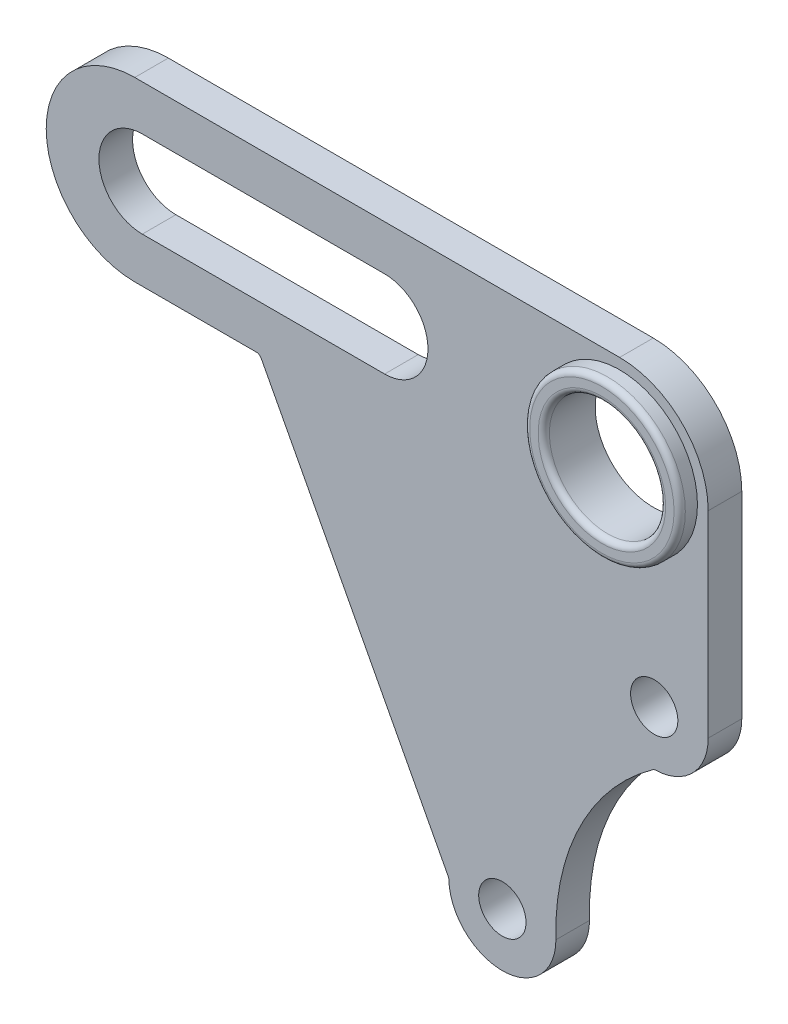
ISO-10303-21;
HEADER;
FILE_DESCRIPTION(('STEP AP214'),'2;1');
FILE_NAME('part.step','',(''),(''),'','','');
FILE_SCHEMA(('AUTOMOTIVE_DESIGN { 1 0 10303 214 1 1 1 1 }'));
ENDSEC;
DATA;
#1=APPLICATION_CONTEXT('core data for automotive mechanical design processes');
#2=APPLICATION_PROTOCOL_DEFINITION('international standard','automotive_design',2000,#1);
#3=PRODUCT_CONTEXT('',#1,'mechanical');
#4=PRODUCT('Part','Part','',(#3));
#5=PRODUCT_RELATED_PRODUCT_CATEGORY('part','',(#4));
#6=PRODUCT_DEFINITION_FORMATION('','',#4);
#7=PRODUCT_DEFINITION_CONTEXT('part definition',#1,'design');
#8=PRODUCT_DEFINITION('design','',#6,#7);
#9=PRODUCT_DEFINITION_SHAPE('','',#8);
#10=(LENGTH_UNIT() NAMED_UNIT(*) SI_UNIT(.MILLI.,.METRE.));
#11=(NAMED_UNIT(*) PLANE_ANGLE_UNIT() SI_UNIT($,.RADIAN.));
#12=(NAMED_UNIT(*) SI_UNIT($,.STERADIAN.) SOLID_ANGLE_UNIT());
#13=UNCERTAINTY_MEASURE_WITH_UNIT(LENGTH_MEASURE(1.E-05),#10,'distance_accuracy_value','');
#14=(GEOMETRIC_REPRESENTATION_CONTEXT(3) GLOBAL_UNCERTAINTY_ASSIGNED_CONTEXT((#13)) GLOBAL_UNIT_ASSIGNED_CONTEXT((#10,
#11,#12)) REPRESENTATION_CONTEXT('',''));
#15=CARTESIAN_POINT('',(0.,0.,0.));
#16=DIRECTION('',(0.,0.,1.));
#17=DIRECTION('',(1.,0.,0.));
#18=AXIS2_PLACEMENT_3D('',#15,#16,#17);
#19=CARTESIAN_POINT('',(0.,0.,5.96));
#20=DIRECTION('',(0.,0.,1.));
#21=DIRECTION('',(1.,0.,0.));
#22=AXIS2_PLACEMENT_3D('',#19,#20,#21);
#23=PLANE('',#22);
#24=DIRECTION('',(1.,0.,0.));
#25=VECTOR('',#24,1.);
#26=CARTESIAN_POINT('',(0.,31.4,5.96));
#27=LINE('',#26,#25);
#28=CARTESIAN_POINT('',(0.,31.4,5.96));
#29=VERTEX_POINT('',#28);
#30=CARTESIAN_POINT('',(85.99,31.4,5.96));
#31=VERTEX_POINT('',#30);
#32=EDGE_CURVE('E208',#29,#31,#27,.T.);
#33=ORIENTED_EDGE('',*,*,#32,.F.);
#34=CARTESIAN_POINT('',(0.,15.7,5.96));
#35=DIRECTION('',(0.,0.,1.));
#36=DIRECTION('',(1.,0.,0.));
#37=AXIS2_PLACEMENT_3D('',#34,#35,#36);
#38=CIRCLE('',#37,15.7);
#39=CARTESIAN_POINT('',(0.,0.,5.96));
#40=VERTEX_POINT('',#39);
#41=EDGE_CURVE('E212',#29,#40,#38,.T.);
#42=ORIENTED_EDGE('',*,*,#41,.T.);
#43=DIRECTION('',(1.,0.,0.));
#44=VECTOR('',#43,1.);
#45=CARTESIAN_POINT('',(0.,0.,5.96));
#46=LINE('',#45,#44);
#47=CARTESIAN_POINT('',(21.5464466169206,0.,5.96));
#48=VERTEX_POINT('',#47);
#49=EDGE_CURVE('E216',#40,#48,#46,.T.);
#50=ORIENTED_EDGE('',*,*,#49,.T.);
#51=CARTESIAN_POINT('',(21.5464466169206,-1.,5.96));
#52=DIRECTION('',(0.,0.,1.));
#53=DIRECTION('',(1.,0.,0.));
#54=AXIS2_PLACEMENT_3D('',#51,#52,#53);
#55=CIRCLE('',#54,1.);
#56=CARTESIAN_POINT('',(22.4312427717955,-0.534021712610418,5.96));
#57=VERTEX_POINT('',#56);
#58=EDGE_CURVE('E354',#48,#57,#55,.F.);
#59=ORIENTED_EDGE('',*,*,#58,.T.);
#60=DIRECTION('',(-0.465978287389586,0.884796154874934,0.));
#61=VECTOR('',#60,1.);
#62=CARTESIAN_POINT('',(17.3404428203445,9.13235190216591,5.96));
#63=LINE('',#62,#61);
#64=CARTESIAN_POINT('',(55.5828466356044,-63.4820440141547,5.96));
#65=VERTEX_POINT('',#64);
#66=EDGE_CURVE('E219',#65,#57,#63,.T.);
#67=ORIENTED_EDGE('',*,*,#66,.F.);
#68=CARTESIAN_POINT('',(54.6980504807294,-63.9480223015443,5.96));
#69=DIRECTION('',(0.,0.,1.));
#70=DIRECTION('',(1.,0.,0.));
#71=AXIS2_PLACEMENT_3D('',#68,#69,#70);
#72=CIRCLE('',#71,1.);
#73=CARTESIAN_POINT('',(55.6977598203455,-63.9239134590913,5.96));
#74=VERTEX_POINT('',#73);
#75=EDGE_CURVE('E349',#65,#74,#72,.F.);
#76=ORIENTED_EDGE('',*,*,#75,.T.);
#77=CARTESIAN_POINT('',(65.19,-63.695,5.96));
#78=DIRECTION('',(0.,0.,1.));
#79=DIRECTION('',(1.,0.,0.));
#80=AXIS2_PLACEMENT_3D('',#77,#78,#79);
#81=CIRCLE('',#80,9.495);
#82=CARTESIAN_POINT('',(74.685,-63.6949999999992,5.96));
#83=VERTEX_POINT('',#82);
#84=EDGE_CURVE('E223',#74,#83,#81,.T.);
#85=ORIENTED_EDGE('',*,*,#84,.T.);
#86=CARTESIAN_POINT('',(115.84412215884,-62.4525221739088,5.96));
#87=DIRECTION('',(0.,0.,1.));
#88=DIRECTION('',(1.,0.,0.));
#89=AXIS2_PLACEMENT_3D('',#86,#87,#88);
#90=CIRCLE('',#89,41.1778713392846);
#91=CARTESIAN_POINT('',(91.8615153032136,-28.9793738839269,5.96));
#92=VERTEX_POINT('',#91);
#93=EDGE_CURVE('E226',#83,#92,#90,.F.);
#94=ORIENTED_EDGE('',*,*,#93,.T.);
#95=CARTESIAN_POINT('',(92.4439302284054,-29.7922655463973,5.96));
#96=DIRECTION('',(0.,0.,1.));
#97=DIRECTION('',(1.,0.,0.));
#98=AXIS2_PLACEMENT_3D('',#95,#96,#97);
#99=CIRCLE('',#98,1.);
#100=CARTESIAN_POINT('',(92.4130731558284,-28.7927417392411,5.96));
#101=VERTEX_POINT('',#100);
#102=EDGE_CURVE('E343',#92,#101,#99,.F.);
#103=ORIENTED_EDGE('',*,*,#102,.T.);
#104=CARTESIAN_POINT('',(92.1177,-19.225,5.96));
#105=DIRECTION('',(0.,0.,1.));
#106=DIRECTION('',(1.,0.,0.));
#107=AXIS2_PLACEMENT_3D('',#104,#105,#106);
#108=CIRCLE('',#107,9.57229999999999);
#109=CARTESIAN_POINT('',(101.69,-19.225,5.96));
#110=VERTEX_POINT('',#109);
#111=EDGE_CURVE('E230',#101,#110,#108,.T.);
#112=ORIENTED_EDGE('',*,*,#111,.T.);
#113=DIRECTION('',(0.,-1.,0.));
#114=VECTOR('',#113,1.);
#115=CARTESIAN_POINT('',(101.69,0.,5.96));
#116=LINE('',#115,#114);
#117=CARTESIAN_POINT('',(101.69,15.7,5.96));
#118=VERTEX_POINT('',#117);
#119=EDGE_CURVE('E233',#118,#110,#116,.T.);
#120=ORIENTED_EDGE('',*,*,#119,.F.);
#121=CARTESIAN_POINT('',(85.99,15.7,5.96));
#122=DIRECTION('',(0.,0.,1.));
#123=DIRECTION('',(1.,0.,0.));
#124=AXIS2_PLACEMENT_3D('',#121,#122,#123);
#125=CIRCLE('',#124,15.7);
#126=EDGE_CURVE('E237',#118,#31,#125,.T.);
#127=ORIENTED_EDGE('',*,*,#126,.T.);
#128=EDGE_LOOP('',(#33,#42,#50,#59,#67,#76,#85,#94,#103,#112,#120,#127));
#129=FACE_BOUND('',#128,.T.);
#130=CARTESIAN_POINT('',(92.1177,-19.225,5.96));
#131=DIRECTION('',(0.,0.,1.));
#132=DIRECTION('',(1.,0.,0.));
#133=AXIS2_PLACEMENT_3D('',#130,#131,#132);
#134=CIRCLE('',#133,4.19499999999999);
#135=CARTESIAN_POINT('',(96.3127,-19.225,5.96));
#136=VERTEX_POINT('',#135);
#137=EDGE_CURVE('E204',#136,#136,#134,.T.);
#138=ORIENTED_EDGE('',*,*,#137,.F.);
#139=EDGE_LOOP('',(#138));
#140=FACE_BOUND('',#139,.T.);
#141=CARTESIAN_POINT('',(65.19,-63.695,5.96));
#142=DIRECTION('',(0.,0.,1.));
#143=DIRECTION('',(1.,0.,0.));
#144=AXIS2_PLACEMENT_3D('',#141,#142,#143);
#145=CIRCLE('',#144,4.195);
#146=CARTESIAN_POINT('',(69.385,-63.695,5.96));
#147=VERTEX_POINT('',#146);
#148=EDGE_CURVE('E200',#147,#147,#145,.T.);
#149=ORIENTED_EDGE('',*,*,#148,.F.);
#150=EDGE_LOOP('',(#149));
#151=FACE_BOUND('',#150,.T.);
#152=CARTESIAN_POINT('',(1.34,15.7,5.96));
#153=DIRECTION('',(0.,0.,1.));
#154=DIRECTION('',(1.,0.,0.));
#155=AXIS2_PLACEMENT_3D('',#152,#153,#154);
#156=CIRCLE('',#155,7.69);
#157=CARTESIAN_POINT('',(1.34,23.39,5.96));
#158=VERTEX_POINT('',#157);
#159=CARTESIAN_POINT('',(1.34,8.01,5.96));
#160=VERTEX_POINT('',#159);
#161=EDGE_CURVE('E163',#158,#160,#156,.T.);
#162=ORIENTED_EDGE('',*,*,#161,.F.);
#163=DIRECTION('',(1.,0.,0.));
#164=VECTOR('',#163,1.);
#165=CARTESIAN_POINT('',(0.,23.39,5.96));
#166=LINE('',#165,#164);
#167=CARTESIAN_POINT('',(44.31,23.39,5.96));
#168=VERTEX_POINT('',#167);
#169=EDGE_CURVE('E175',#158,#168,#166,.T.);
#170=ORIENTED_EDGE('',*,*,#169,.T.);
#171=CARTESIAN_POINT('',(44.31,15.7,5.96));
#172=DIRECTION('',(0.,0.,1.));
#173=DIRECTION('',(1.,0.,0.));
#174=AXIS2_PLACEMENT_3D('',#171,#172,#173);
#175=CIRCLE('',#174,7.69000000000001);
#176=CARTESIAN_POINT('',(44.31,8.01,5.96));
#177=VERTEX_POINT('',#176);
#178=EDGE_CURVE('E181',#177,#168,#175,.T.);
#179=ORIENTED_EDGE('',*,*,#178,.F.);
#180=DIRECTION('',(1.,0.,0.));
#181=VECTOR('',#180,1.);
#182=CARTESIAN_POINT('',(0.,8.01,5.96));
#183=LINE('',#182,#181);
#184=EDGE_CURVE('E185',#160,#177,#183,.T.);
#185=ORIENTED_EDGE('',*,*,#184,.F.);
#186=EDGE_LOOP('',(#162,#170,#179,#185));
#187=FACE_BOUND('',#186,.T.);
#188=CARTESIAN_POINT('',(85.99,15.7,5.96));
#189=DIRECTION('',(0.,0.,1.));
#190=DIRECTION('',(1.,0.,0.));
#191=AXIS2_PLACEMENT_3D('',#188,#189,#190);
#192=CIRCLE('',#191,13.8);
#193=CARTESIAN_POINT('',(99.79,15.7,5.96));
#194=VERTEX_POINT('',#193);
#195=EDGE_CURVE('E194',#194,#194,#192,.T.);
#196=ORIENTED_EDGE('',*,*,#195,.F.);
#197=EDGE_LOOP('',(#196));
#198=FACE_BOUND('',#197,.T.);
#199=ADVANCED_FACE('F45',(#129,#140,#151,#187,#198),#23,.T.);
#200=CARTESIAN_POINT('',(0.,31.4,5.96));
#201=DIRECTION('',(0.,1.,0.));
#202=DIRECTION('',(0.,0.,1.));
#203=AXIS2_PLACEMENT_3D('',#200,#201,#202);
#204=PLANE('',#203);
#205=DIRECTION('',(1.,0.,0.));
#206=VECTOR('',#205,1.);
#207=CARTESIAN_POINT('',(0.,31.4,0.));
#208=LINE('',#207,#206);
#209=CARTESIAN_POINT('',(0.,31.4,0.));
#210=VERTEX_POINT('',#209);
#211=CARTESIAN_POINT('',(85.99,31.4,0.));
#212=VERTEX_POINT('',#211);
#213=EDGE_CURVE('E266',#210,#212,#208,.T.);
#214=ORIENTED_EDGE('',*,*,#213,.F.);
#215=DIRECTION('',(0.,0.,-1.));
#216=VECTOR('',#215,1.);
#217=CARTESIAN_POINT('',(0.,31.4,5.96));
#218=LINE('',#217,#216);
#219=EDGE_CURVE('E310',#29,#210,#218,.T.);
#220=ORIENTED_EDGE('',*,*,#219,.F.);
#221=ORIENTED_EDGE('',*,*,#32,.T.);
#222=DIRECTION('',(0.,0.,-1.));
#223=VECTOR('',#222,1.);
#224=CARTESIAN_POINT('',(85.99,31.4,5.96));
#225=LINE('',#224,#223);
#226=EDGE_CURVE('E171',#31,#212,#225,.T.);
#227=ORIENTED_EDGE('',*,*,#226,.T.);
#228=EDGE_LOOP('',(#214,#220,#221,#227));
#229=FACE_BOUND('',#228,.T.);
#230=ADVANCED_FACE('F396',(#229),#204,.T.);
#231=CARTESIAN_POINT('',(0.,15.7,5.96));
#232=DIRECTION('',(0.,0.,-1.));
#233=DIRECTION('',(-1.,0.,0.));
#234=AXIS2_PLACEMENT_3D('',#231,#232,#233);
#235=CYLINDRICAL_SURFACE('',#234,15.7);
#236=CARTESIAN_POINT('',(0.,15.7,0.));
#237=DIRECTION('',(0.,0.,1.));
#238=DIRECTION('',(1.,0.,0.));
#239=AXIS2_PLACEMENT_3D('',#236,#237,#238);
#240=CIRCLE('',#239,15.7);
#241=CARTESIAN_POINT('',(0.,0.,0.));
#242=VERTEX_POINT('',#241);
#243=EDGE_CURVE('E270',#210,#242,#240,.T.);
#244=ORIENTED_EDGE('',*,*,#243,.T.);
#245=DIRECTION('',(0.,0.,-1.));
#246=VECTOR('',#245,1.);
#247=CARTESIAN_POINT('',(0.,0.,5.96));
#248=LINE('',#247,#246);
#249=EDGE_CURVE('E306',#40,#242,#248,.T.);
#250=ORIENTED_EDGE('',*,*,#249,.F.);
#251=ORIENTED_EDGE('',*,*,#41,.F.);
#252=ORIENTED_EDGE('',*,*,#219,.T.);
#253=EDGE_LOOP('',(#244,#250,#251,#252));
#254=FACE_BOUND('',#253,.T.);
#255=ADVANCED_FACE('F441',(#254),#235,.T.);
#256=CARTESIAN_POINT('',(0.,0.,5.96));
#257=DIRECTION('',(0.,1.,0.));
#258=DIRECTION('',(0.,0.,1.));
#259=AXIS2_PLACEMENT_3D('',#256,#257,#258);
#260=PLANE('',#259);
#261=DIRECTION('',(1.,0.,0.));
#262=VECTOR('',#261,1.);
#263=CARTESIAN_POINT('',(0.,0.,0.));
#264=LINE('',#263,#262);
#265=CARTESIAN_POINT('',(21.5464466169206,0.,0.));
#266=VERTEX_POINT('',#265);
#267=EDGE_CURVE('E274',#242,#266,#264,.T.);
#268=ORIENTED_EDGE('',*,*,#267,.T.);
#269=DIRECTION('',(0.,0.,-1.));
#270=VECTOR('',#269,1.);
#271=CARTESIAN_POINT('',(21.5464466169206,0.,5.96));
#272=LINE('',#271,#270);
#273=EDGE_CURVE('E61',#266,#48,#272,.F.);
#274=ORIENTED_EDGE('',*,*,#273,.T.);
#275=ORIENTED_EDGE('',*,*,#49,.F.);
#276=ORIENTED_EDGE('',*,*,#249,.T.);
#277=EDGE_LOOP('',(#268,#274,#275,#276));
#278=FACE_BOUND('',#277,.T.);
#279=ADVANCED_FACE('F439',(#278),#260,.F.);
#280=CARTESIAN_POINT('',(17.3404428203445,9.13235190216591,5.96));
#281=DIRECTION('',(-0.884796154874934,-0.465978287389586,0.));
#282=DIRECTION('',(0.465978287389586,-0.884796154874934,0.));
#283=AXIS2_PLACEMENT_3D('',#280,#281,#282);
#284=PLANE('',#283);
#285=DIRECTION('',(-0.465978287389586,0.884796154874934,0.));
#286=VECTOR('',#285,1.);
#287=CARTESIAN_POINT('',(17.3404428203445,9.13235190216591,0.));
#288=LINE('',#287,#286);
#289=CARTESIAN_POINT('',(55.5828466356044,-63.4820440141547,0.));
#290=VERTEX_POINT('',#289);
#291=CARTESIAN_POINT('',(22.4312427717955,-0.534021712610418,0.));
#292=VERTEX_POINT('',#291);
#293=EDGE_CURVE('E277',#290,#292,#288,.T.);
#294=ORIENTED_EDGE('',*,*,#293,.F.);
#295=DIRECTION('',(0.,0.,-1.));
#296=VECTOR('',#295,1.);
#297=CARTESIAN_POINT('',(55.5828466356044,-63.4820440141547,5.96));
#298=LINE('',#297,#296);
#299=EDGE_CURVE('E335',#290,#65,#298,.F.);
#300=ORIENTED_EDGE('',*,*,#299,.T.);
#301=ORIENTED_EDGE('',*,*,#66,.T.);
#302=DIRECTION('',(0.,0.,-1.));
#303=VECTOR('',#302,1.);
#304=CARTESIAN_POINT('',(22.4312427717955,-0.534021712610414,5.96));
#305=LINE('',#304,#303);
#306=EDGE_CURVE('E331',#57,#292,#305,.T.);
#307=ORIENTED_EDGE('',*,*,#306,.T.);
#308=EDGE_LOOP('',(#294,#300,#301,#307));
#309=FACE_BOUND('',#308,.T.);
#310=ADVANCED_FACE('F433',(#309),#284,.T.);
#311=CARTESIAN_POINT('',(65.19,-63.695,5.96));
#312=DIRECTION('',(0.,0.,-1.));
#313=DIRECTION('',(-1.,0.,0.));
#314=AXIS2_PLACEMENT_3D('',#311,#312,#313);
#315=CYLINDRICAL_SURFACE('',#314,9.495);
#316=ORIENTED_EDGE('',*,*,#84,.F.);
#317=DIRECTION('',(0.,0.,-1.));
#318=VECTOR('',#317,1.);
#319=CARTESIAN_POINT('',(55.6977598203455,-63.9239134590913,5.96));
#320=LINE('',#319,#318);
#321=CARTESIAN_POINT('',(55.6977598203455,-63.9239134590913,0.));
#322=VERTEX_POINT('',#321);
#323=EDGE_CURVE('E327',#74,#322,#320,.T.);
#324=ORIENTED_EDGE('',*,*,#323,.T.);
#325=CARTESIAN_POINT('',(65.19,-63.695,0.));
#326=DIRECTION('',(0.,0.,1.));
#327=DIRECTION('',(1.,0.,0.));
#328=AXIS2_PLACEMENT_3D('',#325,#326,#327);
#329=CIRCLE('',#328,9.495);
#330=CARTESIAN_POINT('',(74.685,-63.6949999999992,0.));
#331=VERTEX_POINT('',#330);
#332=EDGE_CURVE('E280',#322,#331,#329,.T.);
#333=ORIENTED_EDGE('',*,*,#332,.T.);
#334=DIRECTION('',(0.,0.,-1.));
#335=VECTOR('',#334,1.);
#336=CARTESIAN_POINT('',(74.685,-63.6949999999992,5.96));
#337=LINE('',#336,#335);
#338=EDGE_CURVE('E302',#83,#331,#337,.T.);
#339=ORIENTED_EDGE('',*,*,#338,.F.);
#340=EDGE_LOOP('',(#316,#324,#333,#339));
#341=FACE_BOUND('',#340,.T.);
#342=ADVANCED_FACE('F426',(#341),#315,.T.);
#343=CARTESIAN_POINT('',(115.84412215884,-62.4525221739088,5.96));
#344=DIRECTION('',(0.,0.,-1.));
#345=DIRECTION('',(-1.,0.,0.));
#346=AXIS2_PLACEMENT_3D('',#343,#344,#345);
#347=CYLINDRICAL_SURFACE('',#346,41.1778713392846);
#348=CARTESIAN_POINT('',(115.84412215884,-62.4525221739088,0.));
#349=DIRECTION('',(0.,0.,1.));
#350=DIRECTION('',(1.,0.,0.));
#351=AXIS2_PLACEMENT_3D('',#348,#349,#350);
#352=CIRCLE('',#351,41.1778713392846);
#353=CARTESIAN_POINT('',(91.8615153032136,-28.9793738839269,0.));
#354=VERTEX_POINT('',#353);
#355=EDGE_CURVE('E283',#331,#354,#352,.F.);
#356=ORIENTED_EDGE('',*,*,#355,.T.);
#357=DIRECTION('',(0.,0.,-1.));
#358=VECTOR('',#357,1.);
#359=CARTESIAN_POINT('',(91.8615153032136,-28.9793738839269,5.96));
#360=LINE('',#359,#358);
#361=EDGE_CURVE('E324',#354,#92,#360,.F.);
#362=ORIENTED_EDGE('',*,*,#361,.T.);
#363=ORIENTED_EDGE('',*,*,#93,.F.);
#364=ORIENTED_EDGE('',*,*,#338,.T.);
#365=EDGE_LOOP('',(#356,#362,#363,#364));
#366=FACE_BOUND('',#365,.T.);
#367=ADVANCED_FACE('F417',(#366),#347,.F.);
#368=CARTESIAN_POINT('',(92.1177,-19.225,5.96));
#369=DIRECTION('',(0.,0.,-1.));
#370=DIRECTION('',(-1.,0.,0.));
#371=AXIS2_PLACEMENT_3D('',#368,#369,#370);
#372=CYLINDRICAL_SURFACE('',#371,9.57229999999999);
#373=ORIENTED_EDGE('',*,*,#111,.F.);
#374=DIRECTION('',(0.,0.,-1.));
#375=VECTOR('',#374,1.);
#376=CARTESIAN_POINT('',(92.4130731558284,-28.7927417392411,5.96));
#377=LINE('',#376,#375);
#378=CARTESIAN_POINT('',(92.4130731558284,-28.7927417392411,0.));
#379=VERTEX_POINT('',#378);
#380=EDGE_CURVE('E313',#101,#379,#377,.T.);
#381=ORIENTED_EDGE('',*,*,#380,.T.);
#382=CARTESIAN_POINT('',(92.1177,-19.225,0.));
#383=DIRECTION('',(0.,0.,1.));
#384=DIRECTION('',(1.,0.,0.));
#385=AXIS2_PLACEMENT_3D('',#382,#383,#384);
#386=CIRCLE('',#385,9.57229999999999);
#387=CARTESIAN_POINT('',(101.69,-19.225,0.));
#388=VERTEX_POINT('',#387);
#389=EDGE_CURVE('E287',#379,#388,#386,.T.);
#390=ORIENTED_EDGE('',*,*,#389,.T.);
#391=DIRECTION('',(0.,0.,-1.));
#392=VECTOR('',#391,1.);
#393=CARTESIAN_POINT('',(101.69,-19.225,5.96));
#394=LINE('',#393,#392);
#395=EDGE_CURVE('E298',#110,#388,#394,.T.);
#396=ORIENTED_EDGE('',*,*,#395,.F.);
#397=EDGE_LOOP('',(#373,#381,#390,#396));
#398=FACE_BOUND('',#397,.T.);
#399=ADVANCED_FACE('F410',(#398),#372,.T.);
#400=CARTESIAN_POINT('',(101.69,0.,5.96));
#401=DIRECTION('',(1.,0.,0.));
#402=DIRECTION('',(0.,0.,-1.));
#403=AXIS2_PLACEMENT_3D('',#400,#401,#402);
#404=PLANE('',#403);
#405=DIRECTION('',(0.,-1.,0.));
#406=VECTOR('',#405,1.);
#407=CARTESIAN_POINT('',(101.69,0.,0.));
#408=LINE('',#407,#406);
#409=CARTESIAN_POINT('',(101.69,15.7,0.));
#410=VERTEX_POINT('',#409);
#411=EDGE_CURVE('E191',#410,#388,#408,.T.);
#412=ORIENTED_EDGE('',*,*,#411,.F.);
#413=DIRECTION('',(0.,0.,-1.));
#414=VECTOR('',#413,1.);
#415=CARTESIAN_POINT('',(101.69,15.7,5.96));
#416=LINE('',#415,#414);
#417=EDGE_CURVE('E295',#118,#410,#416,.T.);
#418=ORIENTED_EDGE('',*,*,#417,.F.);
#419=ORIENTED_EDGE('',*,*,#119,.T.);
#420=ORIENTED_EDGE('',*,*,#395,.T.);
#421=EDGE_LOOP('',(#412,#418,#419,#420));
#422=FACE_BOUND('',#421,.T.);
#423=ADVANCED_FACE('F404',(#422),#404,.T.);
#424=CARTESIAN_POINT('',(1.34,15.7,5.96));
#425=DIRECTION('',(0.,0.,-1.));
#426=DIRECTION('',(-1.,0.,0.));
#427=AXIS2_PLACEMENT_3D('',#424,#425,#426);
#428=CYLINDRICAL_SURFACE('',#427,7.69);
#429=CARTESIAN_POINT('',(1.34,15.7,0.));
#430=DIRECTION('',(0.,0.,1.));
#431=DIRECTION('',(1.,0.,0.));
#432=AXIS2_PLACEMENT_3D('',#429,#430,#431);
#433=CIRCLE('',#432,7.69);
#434=CARTESIAN_POINT('',(1.34,23.39,0.));
#435=VERTEX_POINT('',#434);
#436=CARTESIAN_POINT('',(1.34,8.01,0.));
#437=VERTEX_POINT('',#436);
#438=EDGE_CURVE('E166',#435,#437,#433,.T.);
#439=ORIENTED_EDGE('',*,*,#438,.F.);
#440=DIRECTION('',(0.,0.,-1.));
#441=VECTOR('',#440,1.);
#442=CARTESIAN_POINT('',(1.34,23.39,5.96));
#443=LINE('',#442,#441);
#444=EDGE_CURVE('E159',#158,#435,#443,.T.);
#445=ORIENTED_EDGE('',*,*,#444,.F.);
#446=ORIENTED_EDGE('',*,*,#161,.T.);
#447=DIRECTION('',(0.,0.,-1.));
#448=VECTOR('',#447,1.);
#449=CARTESIAN_POINT('',(1.34,8.01,5.96));
#450=LINE('',#449,#448);
#451=EDGE_CURVE('E240',#160,#437,#450,.T.);
#452=ORIENTED_EDGE('',*,*,#451,.T.);
#453=EDGE_LOOP('',(#439,#445,#446,#452));
#454=FACE_BOUND('',#453,.T.);
#455=ADVANCED_FACE('F161',(#454),#428,.F.);
#456=CARTESIAN_POINT('',(0.,23.39,5.96));
#457=DIRECTION('',(0.,1.,0.));
#458=DIRECTION('',(-1.,0.,0.));
#459=AXIS2_PLACEMENT_3D('',#456,#457,#458);
#460=PLANE('',#459);
#461=DIRECTION('',(1.,0.,0.));
#462=VECTOR('',#461,1.);
#463=CARTESIAN_POINT('',(0.,23.39,0.));
#464=LINE('',#463,#462);
#465=CARTESIAN_POINT('',(44.31,23.39,0.));
#466=VERTEX_POINT('',#465);
#467=EDGE_CURVE('E243',#435,#466,#464,.T.);
#468=ORIENTED_EDGE('',*,*,#467,.T.);
#469=DIRECTION('',(0.,0.,-1.));
#470=VECTOR('',#469,1.);
#471=CARTESIAN_POINT('',(44.31,23.39,5.96));
#472=LINE('',#471,#470);
#473=EDGE_CURVE('E172',#168,#466,#472,.T.);
#474=ORIENTED_EDGE('',*,*,#473,.F.);
#475=ORIENTED_EDGE('',*,*,#169,.F.);
#476=ORIENTED_EDGE('',*,*,#444,.T.);
#477=EDGE_LOOP('',(#468,#474,#475,#476));
#478=FACE_BOUND('',#477,.T.);
#479=ADVANCED_FACE('F176',(#478),#460,.F.);
#480=CARTESIAN_POINT('',(44.31,15.7,5.96));
#481=DIRECTION('',(0.,0.,-1.));
#482=DIRECTION('',(-1.,0.,0.));
#483=AXIS2_PLACEMENT_3D('',#480,#481,#482);
#484=CYLINDRICAL_SURFACE('',#483,7.69000000000001);
#485=CARTESIAN_POINT('',(44.31,15.7,0.));
#486=DIRECTION('',(0.,0.,1.));
#487=DIRECTION('',(1.,0.,0.));
#488=AXIS2_PLACEMENT_3D('',#485,#486,#487);
#489=CIRCLE('',#488,7.69000000000001);
#490=CARTESIAN_POINT('',(44.31,8.01,0.));
#491=VERTEX_POINT('',#490);
#492=EDGE_CURVE('E246',#491,#466,#489,.T.);
#493=ORIENTED_EDGE('',*,*,#492,.F.);
#494=DIRECTION('',(0.,0.,-1.));
#495=VECTOR('',#494,1.);
#496=CARTESIAN_POINT('',(44.31,8.01,5.96));
#497=LINE('',#496,#495);
#498=EDGE_CURVE('E316',#177,#491,#497,.T.);
#499=ORIENTED_EDGE('',*,*,#498,.F.);
#500=ORIENTED_EDGE('',*,*,#178,.T.);
#501=ORIENTED_EDGE('',*,*,#473,.T.);
#502=EDGE_LOOP('',(#493,#499,#500,#501));
#503=FACE_BOUND('',#502,.T.);
#504=ADVANCED_FACE('F381',(#503),#484,.F.);
#505=CARTESIAN_POINT('',(85.99,15.7,5.96));
#506=DIRECTION('',(0.,0.,-1.));
#507=DIRECTION('',(-1.,0.,0.));
#508=AXIS2_PLACEMENT_3D('',#505,#506,#507);
#509=CYLINDRICAL_SURFACE('',#508,10.305);
#510=CARTESIAN_POINT('',(85.99,15.7,8.11));
#511=DIRECTION('',(0.,0.,1.));
#512=DIRECTION('',(1.,0.,0.));
#513=AXIS2_PLACEMENT_3D('',#510,#511,#512);
#514=CIRCLE('',#513,10.305);
#515=CARTESIAN_POINT('',(96.295,15.7,8.11));
#516=VERTEX_POINT('',#515);
#517=EDGE_CURVE('E357',#516,#516,#514,.T.);
#518=ORIENTED_EDGE('',*,*,#517,.T.);
#519=EDGE_LOOP('',(#518));
#520=FACE_BOUND('',#519,.T.);
#521=CARTESIAN_POINT('',(85.99,15.7,0.));
#522=DIRECTION('',(0.,0.,1.));
#523=DIRECTION('',(1.,0.,0.));
#524=AXIS2_PLACEMENT_3D('',#521,#522,#523);
#525=CIRCLE('',#524,10.305);
#526=CARTESIAN_POINT('',(96.295,15.7,0.));
#527=VERTEX_POINT('',#526);
#528=EDGE_CURVE('E262',#527,#527,#525,.T.);
#529=ORIENTED_EDGE('',*,*,#528,.F.);
#530=EDGE_LOOP('',(#529));
#531=FACE_BOUND('',#530,.T.);
#532=ADVANCED_FACE('F377',(#520,#531),#509,.F.);
#533=CARTESIAN_POINT('',(92.1177,-19.225,5.96));
#534=DIRECTION('',(0.,0.,-1.));
#535=DIRECTION('',(-1.,0.,0.));
#536=AXIS2_PLACEMENT_3D('',#533,#534,#535);
#537=CYLINDRICAL_SURFACE('',#536,4.19499999999999);
#538=ORIENTED_EDGE('',*,*,#137,.T.);
#539=EDGE_LOOP('',(#538));
#540=FACE_BOUND('',#539,.T.);
#541=CARTESIAN_POINT('',(92.1177,-19.225,0.));
#542=DIRECTION('',(0.,0.,1.));
#543=DIRECTION('',(1.,0.,0.));
#544=AXIS2_PLACEMENT_3D('',#541,#542,#543);
#545=CIRCLE('',#544,4.19499999999999);
#546=CARTESIAN_POINT('',(96.3127,-19.225,0.));
#547=VERTEX_POINT('',#546);
#548=EDGE_CURVE('E258',#547,#547,#545,.T.);
#549=ORIENTED_EDGE('',*,*,#548,.F.);
#550=EDGE_LOOP('',(#549));
#551=FACE_BOUND('',#550,.T.);
#552=ADVANCED_FACE('F380',(#540,#551),#537,.F.);
#553=CARTESIAN_POINT('',(65.19,-63.695,5.96));
#554=DIRECTION('',(0.,0.,-1.));
#555=DIRECTION('',(-1.,0.,0.));
#556=AXIS2_PLACEMENT_3D('',#553,#554,#555);
#557=CYLINDRICAL_SURFACE('',#556,4.195);
#558=ORIENTED_EDGE('',*,*,#148,.T.);
#559=EDGE_LOOP('',(#558));
#560=FACE_BOUND('',#559,.T.);
#561=CARTESIAN_POINT('',(65.19,-63.695,0.));
#562=DIRECTION('',(0.,0.,1.));
#563=DIRECTION('',(1.,0.,0.));
#564=AXIS2_PLACEMENT_3D('',#561,#562,#563);
#565=CIRCLE('',#564,4.195);
#566=CARTESIAN_POINT('',(69.385,-63.695,0.));
#567=VERTEX_POINT('',#566);
#568=EDGE_CURVE('E254',#567,#567,#565,.T.);
#569=ORIENTED_EDGE('',*,*,#568,.F.);
#570=EDGE_LOOP('',(#569));
#571=FACE_BOUND('',#570,.T.);
#572=ADVANCED_FACE('F520',(#560,#571),#557,.F.);
#573=CARTESIAN_POINT('',(0.,8.01,5.96));
#574=DIRECTION('',(0.,1.,0.));
#575=DIRECTION('',(0.,0.,1.));
#576=AXIS2_PLACEMENT_3D('',#573,#574,#575);
#577=PLANE('',#576);
#578=DIRECTION('',(1.,0.,0.));
#579=VECTOR('',#578,1.);
#580=CARTESIAN_POINT('',(0.,8.01,0.));
#581=LINE('',#580,#579);
#582=EDGE_CURVE('E250',#437,#491,#581,.T.);
#583=ORIENTED_EDGE('',*,*,#582,.F.);
#584=ORIENTED_EDGE('',*,*,#451,.F.);
#585=ORIENTED_EDGE('',*,*,#184,.T.);
#586=ORIENTED_EDGE('',*,*,#498,.T.);
#587=EDGE_LOOP('',(#583,#584,#585,#586));
#588=FACE_BOUND('',#587,.T.);
#589=ADVANCED_FACE('F459',(#588),#577,.T.);
#590=CARTESIAN_POINT('',(85.99,15.7,5.96));
#591=DIRECTION('',(0.,0.,-1.));
#592=DIRECTION('',(-1.,0.,0.));
#593=AXIS2_PLACEMENT_3D('',#590,#591,#592);
#594=CYLINDRICAL_SURFACE('',#593,15.7);
#595=CARTESIAN_POINT('',(85.99,15.7,0.));
#596=DIRECTION('',(0.,0.,1.));
#597=DIRECTION('',(1.,0.,0.));
#598=AXIS2_PLACEMENT_3D('',#595,#596,#597);
#599=CIRCLE('',#598,15.7);
#600=EDGE_CURVE('E187',#410,#212,#599,.T.);
#601=ORIENTED_EDGE('',*,*,#600,.T.);
#602=ORIENTED_EDGE('',*,*,#226,.F.);
#603=ORIENTED_EDGE('',*,*,#126,.F.);
#604=ORIENTED_EDGE('',*,*,#417,.T.);
#605=EDGE_LOOP('',(#601,#602,#603,#604));
#606=FACE_BOUND('',#605,.T.);
#607=ADVANCED_FACE('F388',(#606),#594,.T.);
#608=CARTESIAN_POINT('',(0.,0.,0.));
#609=DIRECTION('',(0.,0.,1.));
#610=DIRECTION('',(1.,0.,0.));
#611=AXIS2_PLACEMENT_3D('',#608,#609,#610);
#612=PLANE('',#611);
#613=ORIENTED_EDGE('',*,*,#438,.T.);
#614=ORIENTED_EDGE('',*,*,#582,.T.);
#615=ORIENTED_EDGE('',*,*,#492,.T.);
#616=ORIENTED_EDGE('',*,*,#467,.F.);
#617=EDGE_LOOP('',(#613,#614,#615,#616));
#618=FACE_BOUND('',#617,.T.);
#619=ORIENTED_EDGE('',*,*,#568,.T.);
#620=EDGE_LOOP('',(#619));
#621=FACE_BOUND('',#620,.T.);
#622=ORIENTED_EDGE('',*,*,#548,.T.);
#623=EDGE_LOOP('',(#622));
#624=FACE_BOUND('',#623,.T.);
#625=ORIENTED_EDGE('',*,*,#528,.T.);
#626=EDGE_LOOP('',(#625));
#627=FACE_BOUND('',#626,.T.);
#628=ORIENTED_EDGE('',*,*,#213,.T.);
#629=ORIENTED_EDGE('',*,*,#600,.F.);
#630=ORIENTED_EDGE('',*,*,#411,.T.);
#631=ORIENTED_EDGE('',*,*,#389,.F.);
#632=CARTESIAN_POINT('',(92.4439302284054,-29.7922655463973,0.));
#633=DIRECTION('',(0.,0.,1.));
#634=DIRECTION('',(1.,0.,0.));
#635=AXIS2_PLACEMENT_3D('',#632,#633,#634);
#636=CIRCLE('',#635,1.);
#637=EDGE_CURVE('E340',#379,#354,#636,.T.);
#638=ORIENTED_EDGE('',*,*,#637,.T.);
#639=ORIENTED_EDGE('',*,*,#355,.F.);
#640=ORIENTED_EDGE('',*,*,#332,.F.);
#641=CARTESIAN_POINT('',(54.6980504807294,-63.9480223015443,0.));
#642=DIRECTION('',(0.,0.,1.));
#643=DIRECTION('',(1.,0.,0.));
#644=AXIS2_PLACEMENT_3D('',#641,#642,#643);
#645=CIRCLE('',#644,1.);
#646=EDGE_CURVE('E346',#322,#290,#645,.T.);
#647=ORIENTED_EDGE('',*,*,#646,.T.);
#648=ORIENTED_EDGE('',*,*,#293,.T.);
#649=CARTESIAN_POINT('',(21.5464466169206,-1.,0.));
#650=DIRECTION('',(0.,0.,1.));
#651=DIRECTION('',(1.,0.,0.));
#652=AXIS2_PLACEMENT_3D('',#649,#650,#651);
#653=CIRCLE('',#652,1.);
#654=EDGE_CURVE('E69',#292,#266,#653,.T.);
#655=ORIENTED_EDGE('',*,*,#654,.T.);
#656=ORIENTED_EDGE('',*,*,#267,.F.);
#657=ORIENTED_EDGE('',*,*,#243,.F.);
#658=EDGE_LOOP('',(#628,#629,#630,#631,#638,#639,#640,#647,#648,#655,#656,#657));
#659=FACE_BOUND('',#658,.T.);
#660=ADVANCED_FACE('F385',(#618,#621,#624,#627,#659),#612,.F.);
#661=CARTESIAN_POINT('',(92.4439302284054,-29.7922655463973,5.96));
#662=DIRECTION('',(0.,0.,-1.));
#663=DIRECTION('',(-1.,0.,0.));
#664=AXIS2_PLACEMENT_3D('',#661,#662,#663);
#665=CYLINDRICAL_SURFACE('',#664,1.);
#666=ORIENTED_EDGE('',*,*,#102,.F.);
#667=ORIENTED_EDGE('',*,*,#361,.F.);
#668=ORIENTED_EDGE('',*,*,#637,.F.);
#669=ORIENTED_EDGE('',*,*,#380,.F.);
#670=EDGE_LOOP('',(#666,#667,#668,#669));
#671=FACE_BOUND('',#670,.T.);
#672=ADVANCED_FACE('F387',(#671),#665,.F.);
#673=CARTESIAN_POINT('',(54.6980504807294,-63.9480223015443,5.96));
#674=DIRECTION('',(0.,0.,-1.));
#675=DIRECTION('',(-1.,0.,0.));
#676=AXIS2_PLACEMENT_3D('',#673,#674,#675);
#677=CYLINDRICAL_SURFACE('',#676,1.);
#678=ORIENTED_EDGE('',*,*,#75,.F.);
#679=ORIENTED_EDGE('',*,*,#299,.F.);
#680=ORIENTED_EDGE('',*,*,#646,.F.);
#681=ORIENTED_EDGE('',*,*,#323,.F.);
#682=EDGE_LOOP('',(#678,#679,#680,#681));
#683=FACE_BOUND('',#682,.T.);
#684=ADVANCED_FACE('F429',(#683),#677,.F.);
#685=CARTESIAN_POINT('',(21.5464466169206,-1.,5.96));
#686=DIRECTION('',(0.,0.,-1.));
#687=DIRECTION('',(-1.,0.,0.));
#688=AXIS2_PLACEMENT_3D('',#685,#686,#687);
#689=CYLINDRICAL_SURFACE('',#688,1.);
#690=ORIENTED_EDGE('',*,*,#58,.F.);
#691=ORIENTED_EDGE('',*,*,#273,.F.);
#692=ORIENTED_EDGE('',*,*,#654,.F.);
#693=ORIENTED_EDGE('',*,*,#306,.F.);
#694=EDGE_LOOP('',(#690,#691,#692,#693));
#695=FACE_BOUND('',#694,.T.);
#696=ADVANCED_FACE('F437',(#695),#689,.F.);
#697=CARTESIAN_POINT('',(85.99,15.7,9.11));
#698=DIRECTION('',(0.,0.,1.));
#699=DIRECTION('',(1.,0.,0.));
#700=AXIS2_PLACEMENT_3D('',#697,#698,#699);
#701=PLANE('',#700);
#702=CARTESIAN_POINT('',(85.99,15.7,9.11));
#703=DIRECTION('',(0.,0.,1.));
#704=DIRECTION('',(1.,0.,0.));
#705=AXIS2_PLACEMENT_3D('',#702,#703,#704);
#706=CIRCLE('',#705,11.305);
#707=CARTESIAN_POINT('',(97.295,15.7,9.11));
#708=VERTEX_POINT('',#707);
#709=EDGE_CURVE('E54',#708,#708,#706,.F.);
#710=ORIENTED_EDGE('',*,*,#709,.T.);
#711=EDGE_LOOP('',(#710));
#712=FACE_BOUND('',#711,.T.);
#713=CARTESIAN_POINT('',(85.99,15.7,9.11));
#714=DIRECTION('',(0.,0.,1.));
#715=DIRECTION('',(1.,0.,0.));
#716=AXIS2_PLACEMENT_3D('',#713,#714,#715);
#717=CIRCLE('',#716,12.8);
#718=CARTESIAN_POINT('',(98.79,15.7,9.11));
#719=VERTEX_POINT('',#718);
#720=EDGE_CURVE('E361',#719,#719,#717,.T.);
#721=ORIENTED_EDGE('',*,*,#720,.T.);
#722=EDGE_LOOP('',(#721));
#723=FACE_BOUND('',#722,.T.);
#724=ADVANCED_FACE('F368',(#712,#723),#701,.T.);
#725=CARTESIAN_POINT('',(85.99,15.7,9.11));
#726=DIRECTION('',(0.,0.,-1.));
#727=DIRECTION('',(-1.,0.,0.));
#728=AXIS2_PLACEMENT_3D('',#725,#726,#727);
#729=CYLINDRICAL_SURFACE('',#728,13.8);
#730=CARTESIAN_POINT('',(85.99,15.7,8.11));
#731=DIRECTION('',(0.,0.,1.));
#732=DIRECTION('',(1.,0.,0.));
#733=AXIS2_PLACEMENT_3D('',#730,#731,#732);
#734=CIRCLE('',#733,13.8);
#735=CARTESIAN_POINT('',(99.79,15.7,8.11));
#736=VERTEX_POINT('',#735);
#737=EDGE_CURVE('E11',#736,#736,#734,.F.);
#738=ORIENTED_EDGE('',*,*,#737,.T.);
#739=EDGE_LOOP('',(#738));
#740=FACE_BOUND('',#739,.T.);
#741=ORIENTED_EDGE('',*,*,#195,.T.);
#742=EDGE_LOOP('',(#741));
#743=FACE_BOUND('',#742,.T.);
#744=ADVANCED_FACE('F374',(#740,#743),#729,.T.);
#745=CARTESIAN_POINT('',(85.99,15.7,8.11));
#746=DIRECTION('',(0.,0.,1.));
#747=DIRECTION('',(1.,0.,0.));
#748=AXIS2_PLACEMENT_3D('',#745,#746,#747);
#749=TOROIDAL_SURFACE('',#748,11.305,1.);
#750=ORIENTED_EDGE('',*,*,#709,.F.);
#751=EDGE_LOOP('',(#750));
#752=FACE_BOUND('',#751,.T.);
#753=ORIENTED_EDGE('',*,*,#517,.F.);
#754=EDGE_LOOP('',(#753));
#755=FACE_BOUND('',#754,.T.);
#756=ADVANCED_FACE('F371',(#752,#755),#749,.T.);
#757=CARTESIAN_POINT('',(85.99,15.7,8.11));
#758=DIRECTION('',(0.,0.,1.));
#759=DIRECTION('',(1.,0.,0.));
#760=AXIS2_PLACEMENT_3D('',#757,#758,#759);
#761=TOROIDAL_SURFACE('',#760,12.8,1.);
#762=ORIENTED_EDGE('',*,*,#737,.F.);
#763=EDGE_LOOP('',(#762));
#764=FACE_BOUND('',#763,.T.);
#765=ORIENTED_EDGE('',*,*,#720,.F.);
#766=EDGE_LOOP('',(#765));
#767=FACE_BOUND('',#766,.T.);
#768=ADVANCED_FACE('F47',(#764,#767),#761,.T.);
#769=CLOSED_SHELL('',(#199,#230,#255,#279,#310,#342,#367,#399,#423,#455,#479,#504,#532,#552,
#572,#589,#607,#660,#672,#684,#696,#724,#744,#756,#768));
#770=MANIFOLD_SOLID_BREP('B2',#769);
#771=ADVANCED_BREP_SHAPE_REPRESENTATION('',(#18,#770),#14);
#772=SHAPE_DEFINITION_REPRESENTATION(#9,#771);
ENDSEC;
END-ISO-10303-21;
